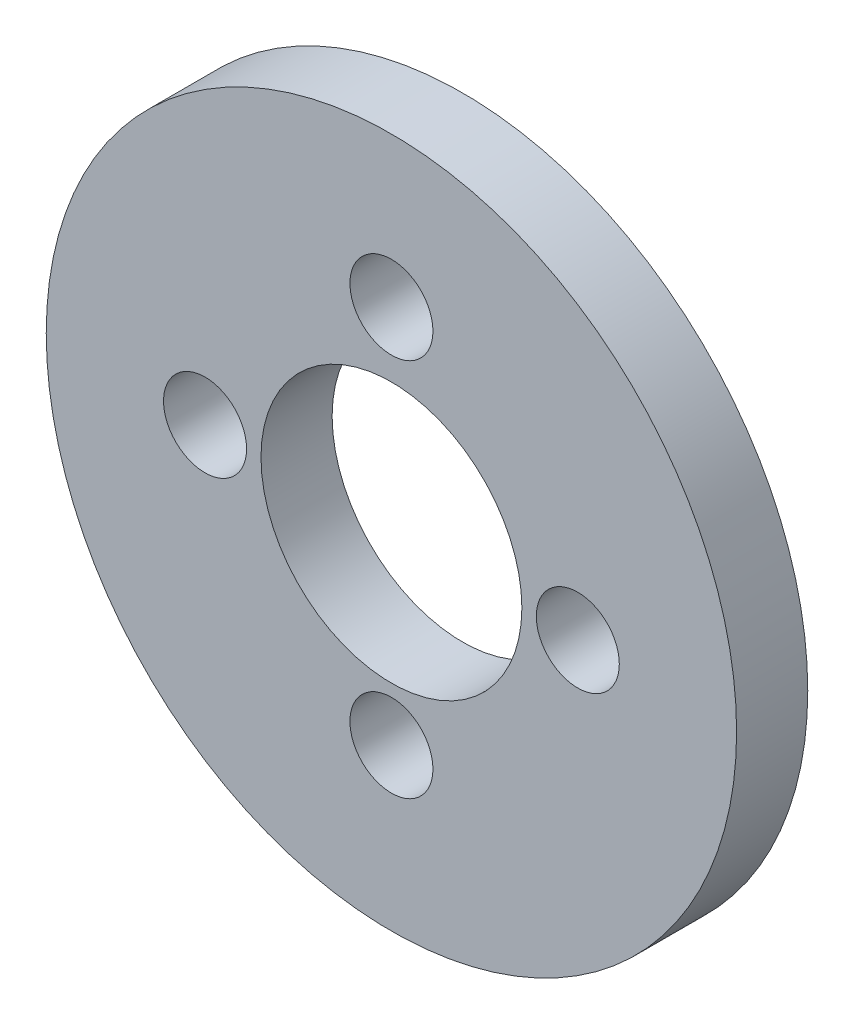
ISO-10303-21;
HEADER;
FILE_DESCRIPTION(('STEP AP214'),'2;1');
FILE_NAME('part.step','',(''),(''),'','','');
FILE_SCHEMA(('AUTOMOTIVE_DESIGN { 1 0 10303 214 1 1 1 1 }'));
ENDSEC;
DATA;
#1=APPLICATION_CONTEXT('core data for automotive mechanical design processes');
#2=APPLICATION_PROTOCOL_DEFINITION('international standard','automotive_design',2000,#1);
#3=PRODUCT_CONTEXT('',#1,'mechanical');
#4=PRODUCT('Part','Part','',(#3));
#5=PRODUCT_RELATED_PRODUCT_CATEGORY('part','',(#4));
#6=PRODUCT_DEFINITION_FORMATION('','',#4);
#7=PRODUCT_DEFINITION_CONTEXT('part definition',#1,'design');
#8=PRODUCT_DEFINITION('design','',#6,#7);
#9=PRODUCT_DEFINITION_SHAPE('','',#8);
#10=(LENGTH_UNIT() NAMED_UNIT(*) SI_UNIT(.MILLI.,.METRE.));
#11=(NAMED_UNIT(*) PLANE_ANGLE_UNIT() SI_UNIT($,.RADIAN.));
#12=(NAMED_UNIT(*) SI_UNIT($,.STERADIAN.) SOLID_ANGLE_UNIT());
#13=UNCERTAINTY_MEASURE_WITH_UNIT(LENGTH_MEASURE(1.E-05),#10,'distance_accuracy_value','');
#14=(GEOMETRIC_REPRESENTATION_CONTEXT(3) GLOBAL_UNCERTAINTY_ASSIGNED_CONTEXT((#13)) GLOBAL_UNIT_ASSIGNED_CONTEXT((#10,
#11,#12)) REPRESENTATION_CONTEXT('',''));
#15=CARTESIAN_POINT('',(0.,0.,0.));
#16=DIRECTION('',(0.,0.,1.));
#17=DIRECTION('',(1.,0.,0.));
#18=AXIS2_PLACEMENT_3D('',#15,#16,#17);
#19=CARTESIAN_POINT('',(0.,0.,3.));
#20=DIRECTION('',(0.,0.,-1.));
#21=DIRECTION('',(-1.,0.,0.));
#22=AXIS2_PLACEMENT_3D('',#19,#20,#21);
#23=CYLINDRICAL_SURFACE('',#22,14.5546421061326);
#24=CARTESIAN_POINT('',(0.,0.,3.));
#25=DIRECTION('',(0.,0.,1.));
#26=DIRECTION('',(1.,0.,0.));
#27=AXIS2_PLACEMENT_3D('',#24,#25,#26);
#28=CIRCLE('',#27,14.5546421061326);
#29=CARTESIAN_POINT('',(14.5546421061326,0.,3.));
#30=VERTEX_POINT('',#29);
#31=EDGE_CURVE('E11',#30,#30,#28,.T.);
#32=ORIENTED_EDGE('',*,*,#31,.F.);
#33=EDGE_LOOP('',(#32));
#34=FACE_BOUND('',#33,.T.);
#35=CARTESIAN_POINT('',(0.,0.,0.));
#36=DIRECTION('',(0.,0.,1.));
#37=DIRECTION('',(1.,0.,0.));
#38=AXIS2_PLACEMENT_3D('',#35,#36,#37);
#39=CIRCLE('',#38,14.5546421061326);
#40=CARTESIAN_POINT('',(14.5546421061326,0.,0.));
#41=VERTEX_POINT('',#40);
#42=EDGE_CURVE('E48',#41,#41,#39,.T.);
#43=ORIENTED_EDGE('',*,*,#42,.T.);
#44=EDGE_LOOP('',(#43));
#45=FACE_BOUND('',#44,.T.);
#46=ADVANCED_FACE('F44',(#34,#45),#23,.T.);
#47=CARTESIAN_POINT('',(0.,8.22805291067423,3.));
#48=DIRECTION('',(0.,0.,-1.));
#49=DIRECTION('',(-1.,0.,0.));
#50=AXIS2_PLACEMENT_3D('',#47,#48,#49);
#51=CYLINDRICAL_SURFACE('',#50,1.75);
#52=CARTESIAN_POINT('',(0.,8.22805291067423,3.));
#53=DIRECTION('',(0.,0.,1.));
#54=DIRECTION('',(1.,0.,0.));
#55=AXIS2_PLACEMENT_3D('',#52,#53,#54);
#56=CIRCLE('',#55,1.75);
#57=CARTESIAN_POINT('',(1.75,8.22805291067423,3.));
#58=VERTEX_POINT('',#57);
#59=EDGE_CURVE('E53',#58,#58,#56,.T.);
#60=ORIENTED_EDGE('',*,*,#59,.T.);
#61=EDGE_LOOP('',(#60));
#62=FACE_BOUND('',#61,.T.);
#63=CARTESIAN_POINT('',(0.,8.22805291067423,0.));
#64=DIRECTION('',(0.,0.,1.));
#65=DIRECTION('',(1.,0.,0.));
#66=AXIS2_PLACEMENT_3D('',#63,#64,#65);
#67=CIRCLE('',#66,1.75);
#68=CARTESIAN_POINT('',(1.75,8.22805291067423,0.));
#69=VERTEX_POINT('',#68);
#70=EDGE_CURVE('E75',#69,#69,#67,.T.);
#71=ORIENTED_EDGE('',*,*,#70,.F.);
#72=EDGE_LOOP('',(#71));
#73=FACE_BOUND('',#72,.T.);
#74=ADVANCED_FACE('F113',(#62,#73),#51,.F.);
#75=CARTESIAN_POINT('',(-7.8582527798574,0.,3.));
#76=DIRECTION('',(0.,0.,-1.));
#77=DIRECTION('',(-1.,0.,0.));
#78=AXIS2_PLACEMENT_3D('',#75,#76,#77);
#79=CYLINDRICAL_SURFACE('',#78,1.75);
#80=CARTESIAN_POINT('',(-7.8582527798574,0.,3.));
#81=DIRECTION('',(0.,0.,1.));
#82=DIRECTION('',(1.,0.,0.));
#83=AXIS2_PLACEMENT_3D('',#80,#81,#82);
#84=CIRCLE('',#83,1.75);
#85=CARTESIAN_POINT('',(-6.1082527798574,0.,3.));
#86=VERTEX_POINT('',#85);
#87=EDGE_CURVE('E59',#86,#86,#84,.T.);
#88=ORIENTED_EDGE('',*,*,#87,.T.);
#89=EDGE_LOOP('',(#88));
#90=FACE_BOUND('',#89,.T.);
#91=CARTESIAN_POINT('',(-7.8582527798574,0.,0.));
#92=DIRECTION('',(0.,0.,1.));
#93=DIRECTION('',(1.,0.,0.));
#94=AXIS2_PLACEMENT_3D('',#91,#92,#93);
#95=CIRCLE('',#94,1.75);
#96=CARTESIAN_POINT('',(-6.1082527798574,0.,0.));
#97=VERTEX_POINT('',#96);
#98=EDGE_CURVE('E72',#97,#97,#95,.T.);
#99=ORIENTED_EDGE('',*,*,#98,.F.);
#100=EDGE_LOOP('',(#99));
#101=FACE_BOUND('',#100,.T.);
#102=ADVANCED_FACE('F101',(#90,#101),#79,.F.);
#103=CARTESIAN_POINT('',(0.,-7.7658027471532,3.));
#104=DIRECTION('',(0.,0.,-1.));
#105=DIRECTION('',(-1.,0.,0.));
#106=AXIS2_PLACEMENT_3D('',#103,#104,#105);
#107=CYLINDRICAL_SURFACE('',#106,1.75);
#108=CARTESIAN_POINT('',(0.,-7.7658027471532,3.));
#109=DIRECTION('',(0.,0.,1.));
#110=DIRECTION('',(1.,0.,0.));
#111=AXIS2_PLACEMENT_3D('',#108,#109,#110);
#112=CIRCLE('',#111,1.75);
#113=CARTESIAN_POINT('',(1.75,-7.7658027471532,3.));
#114=VERTEX_POINT('',#113);
#115=EDGE_CURVE('E87',#114,#114,#112,.T.);
#116=ORIENTED_EDGE('',*,*,#115,.T.);
#117=EDGE_LOOP('',(#116));
#118=FACE_BOUND('',#117,.T.);
#119=CARTESIAN_POINT('',(0.,-7.7658027471532,0.));
#120=DIRECTION('',(0.,0.,1.));
#121=DIRECTION('',(1.,0.,0.));
#122=AXIS2_PLACEMENT_3D('',#119,#120,#121);
#123=CIRCLE('',#122,1.75);
#124=CARTESIAN_POINT('',(1.75,-7.7658027471532,0.));
#125=VERTEX_POINT('',#124);
#126=EDGE_CURVE('E67',#125,#125,#123,.T.);
#127=ORIENTED_EDGE('',*,*,#126,.F.);
#128=EDGE_LOOP('',(#127));
#129=FACE_BOUND('',#128,.T.);
#130=ADVANCED_FACE('F121',(#118,#129),#107,.F.);
#131=CARTESIAN_POINT('',(7.85825277985741,0.,3.));
#132=DIRECTION('',(0.,0.,-1.));
#133=DIRECTION('',(-1.,0.,0.));
#134=AXIS2_PLACEMENT_3D('',#131,#132,#133);
#135=CYLINDRICAL_SURFACE('',#134,1.75);
#136=CARTESIAN_POINT('',(7.85825277985741,0.,3.));
#137=DIRECTION('',(0.,0.,1.));
#138=DIRECTION('',(1.,0.,0.));
#139=AXIS2_PLACEMENT_3D('',#136,#137,#138);
#140=CIRCLE('',#139,1.75);
#141=CARTESIAN_POINT('',(9.60825277985741,0.,3.));
#142=VERTEX_POINT('',#141);
#143=EDGE_CURVE('E82',#142,#142,#140,.T.);
#144=ORIENTED_EDGE('',*,*,#143,.T.);
#145=EDGE_LOOP('',(#144));
#146=FACE_BOUND('',#145,.T.);
#147=CARTESIAN_POINT('',(7.85825277985741,0.,0.));
#148=DIRECTION('',(0.,0.,1.));
#149=DIRECTION('',(1.,0.,0.));
#150=AXIS2_PLACEMENT_3D('',#147,#148,#149);
#151=CIRCLE('',#150,1.75);
#152=CARTESIAN_POINT('',(9.60825277985741,0.,0.));
#153=VERTEX_POINT('',#152);
#154=EDGE_CURVE('E63',#153,#153,#151,.T.);
#155=ORIENTED_EDGE('',*,*,#154,.F.);
#156=EDGE_LOOP('',(#155));
#157=FACE_BOUND('',#156,.T.);
#158=ADVANCED_FACE('F46',(#146,#157),#135,.F.);
#159=CARTESIAN_POINT('',(0.,0.,0.));
#160=DIRECTION('',(0.,0.,1.));
#161=DIRECTION('',(1.,0.,0.));
#162=AXIS2_PLACEMENT_3D('',#159,#160,#161);
#163=PLANE('',#162);
#164=CARTESIAN_POINT('',(0.,0.,0.));
#165=DIRECTION('',(0.,0.,1.));
#166=DIRECTION('',(1.,0.,0.));
#167=AXIS2_PLACEMENT_3D('',#164,#165,#166);
#168=CIRCLE('',#167,5.5);
#169=CARTESIAN_POINT('',(5.5,0.,0.));
#170=VERTEX_POINT('',#169);
#171=EDGE_CURVE('E68',#170,#170,#168,.T.);
#172=ORIENTED_EDGE('',*,*,#171,.T.);
#173=EDGE_LOOP('',(#172));
#174=FACE_BOUND('',#173,.T.);
#175=ORIENTED_EDGE('',*,*,#154,.T.);
#176=EDGE_LOOP('',(#175));
#177=FACE_BOUND('',#176,.T.);
#178=ORIENTED_EDGE('',*,*,#126,.T.);
#179=EDGE_LOOP('',(#178));
#180=FACE_BOUND('',#179,.T.);
#181=ORIENTED_EDGE('',*,*,#98,.T.);
#182=EDGE_LOOP('',(#181));
#183=FACE_BOUND('',#182,.T.);
#184=ORIENTED_EDGE('',*,*,#70,.T.);
#185=EDGE_LOOP('',(#184));
#186=FACE_BOUND('',#185,.T.);
#187=ORIENTED_EDGE('',*,*,#42,.F.);
#188=EDGE_LOOP('',(#187));
#189=FACE_BOUND('',#188,.T.);
#190=ADVANCED_FACE('F108',(#174,#177,#180,#183,#186,#189),#163,.F.);
#191=CARTESIAN_POINT('',(0.,0.,3.));
#192=DIRECTION('',(0.,0.,1.));
#193=DIRECTION('',(1.,0.,0.));
#194=AXIS2_PLACEMENT_3D('',#191,#192,#193);
#195=PLANE('',#194);
#196=CARTESIAN_POINT('',(0.,0.,3.));
#197=DIRECTION('',(0.,0.,1.));
#198=DIRECTION('',(1.,0.,0.));
#199=AXIS2_PLACEMENT_3D('',#196,#197,#198);
#200=CIRCLE('',#199,5.5);
#201=CARTESIAN_POINT('',(5.5,0.,3.));
#202=VERTEX_POINT('',#201);
#203=EDGE_CURVE('E95',#202,#202,#200,.T.);
#204=ORIENTED_EDGE('',*,*,#203,.F.);
#205=EDGE_LOOP('',(#204));
#206=FACE_BOUND('',#205,.T.);
#207=ORIENTED_EDGE('',*,*,#143,.F.);
#208=EDGE_LOOP('',(#207));
#209=FACE_BOUND('',#208,.T.);
#210=ORIENTED_EDGE('',*,*,#115,.F.);
#211=EDGE_LOOP('',(#210));
#212=FACE_BOUND('',#211,.T.);
#213=ORIENTED_EDGE('',*,*,#87,.F.);
#214=EDGE_LOOP('',(#213));
#215=FACE_BOUND('',#214,.T.);
#216=ORIENTED_EDGE('',*,*,#59,.F.);
#217=EDGE_LOOP('',(#216));
#218=FACE_BOUND('',#217,.T.);
#219=ORIENTED_EDGE('',*,*,#31,.T.);
#220=EDGE_LOOP('',(#219));
#221=FACE_BOUND('',#220,.T.);
#222=ADVANCED_FACE('F104',(#206,#209,#212,#215,#218,#221),#195,.T.);
#223=CARTESIAN_POINT('',(0.,0.,0.));
#224=DIRECTION('',(0.,0.,1.));
#225=DIRECTION('',(1.,0.,0.));
#226=AXIS2_PLACEMENT_3D('',#223,#224,#225);
#227=CYLINDRICAL_SURFACE('',#226,5.5);
#228=ORIENTED_EDGE('',*,*,#171,.F.);
#229=EDGE_LOOP('',(#228));
#230=FACE_BOUND('',#229,.T.);
#231=ORIENTED_EDGE('',*,*,#203,.T.);
#232=EDGE_LOOP('',(#231));
#233=FACE_BOUND('',#232,.T.);
#234=ADVANCED_FACE('F107',(#230,#233),#227,.F.);
#235=CLOSED_SHELL('',(#46,#74,#102,#130,#158,#190,#222,#234));
#236=MANIFOLD_SOLID_BREP('B2',#235);
#237=ADVANCED_BREP_SHAPE_REPRESENTATION('',(#18,#236),#14);
#238=SHAPE_DEFINITION_REPRESENTATION(#9,#237);
ENDSEC;
END-ISO-10303-21;
